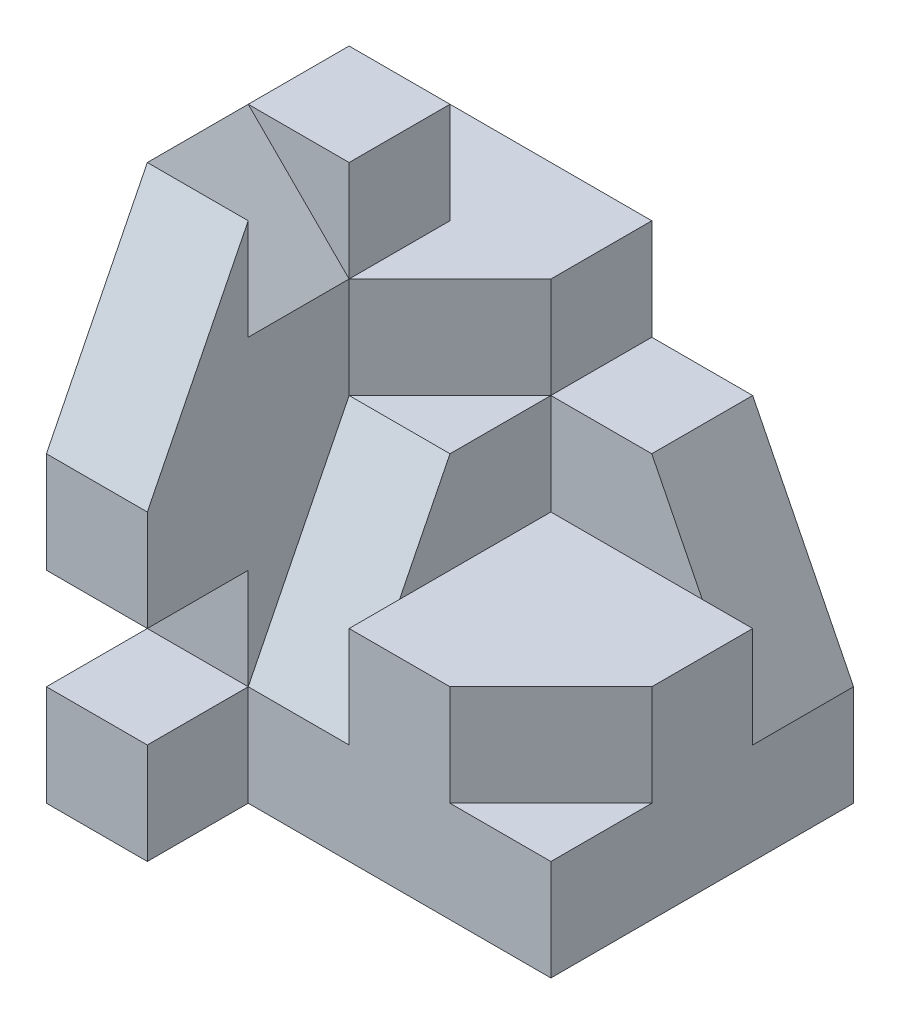
ISO-10303-21;
HEADER;
FILE_DESCRIPTION(('STEP AP214'),'2;1');
FILE_NAME('part.step','',(''),(''),'','','');
FILE_SCHEMA(('AUTOMOTIVE_DESIGN { 1 0 10303 214 1 1 1 1 }'));
ENDSEC;
DATA;
#1=APPLICATION_CONTEXT('core data for automotive mechanical design processes');
#2=APPLICATION_PROTOCOL_DEFINITION('international standard','automotive_design',2000,#1);
#3=PRODUCT_CONTEXT('',#1,'mechanical');
#4=PRODUCT('Part','Part','',(#3));
#5=PRODUCT_RELATED_PRODUCT_CATEGORY('part','',(#4));
#6=PRODUCT_DEFINITION_FORMATION('','',#4);
#7=PRODUCT_DEFINITION_CONTEXT('part definition',#1,'design');
#8=PRODUCT_DEFINITION('design','',#6,#7);
#9=PRODUCT_DEFINITION_SHAPE('','',#8);
#10=(LENGTH_UNIT() NAMED_UNIT(*) SI_UNIT(.MILLI.,.METRE.));
#11=(NAMED_UNIT(*) PLANE_ANGLE_UNIT() SI_UNIT($,.RADIAN.));
#12=(NAMED_UNIT(*) SI_UNIT($,.STERADIAN.) SOLID_ANGLE_UNIT());
#13=UNCERTAINTY_MEASURE_WITH_UNIT(LENGTH_MEASURE(1.E-05),#10,'distance_accuracy_value','');
#14=(GEOMETRIC_REPRESENTATION_CONTEXT(3) GLOBAL_UNCERTAINTY_ASSIGNED_CONTEXT((#13)) GLOBAL_UNIT_ASSIGNED_CONTEXT((#10,
#11,#12)) REPRESENTATION_CONTEXT('',''));
#15=CARTESIAN_POINT('',(0.,0.,0.));
#16=DIRECTION('',(0.,0.,1.));
#17=DIRECTION('',(1.,0.,0.));
#18=AXIS2_PLACEMENT_3D('',#15,#16,#17);
#19=CARTESIAN_POINT('',(-0.999999999999999,-2.5,3.));
#20=DIRECTION('',(-1.,0.,0.));
#21=DIRECTION('',(0.,0.,1.));
#22=AXIS2_PLACEMENT_3D('',#19,#20,#21);
#23=PLANE('',#22);
#24=DIRECTION('',(0.,0.,1.));
#25=VECTOR('',#24,1.);
#26=CARTESIAN_POINT('',(-0.999999999999999,2.5,1.));
#27=LINE('',#26,#25);
#28=CARTESIAN_POINT('',(-0.999999999999999,2.5,1.));
#29=VERTEX_POINT('',#28);
#30=CARTESIAN_POINT('',(-1.,2.5,2.));
#31=VERTEX_POINT('',#30);
#32=EDGE_CURVE('E222',#29,#31,#27,.T.);
#33=ORIENTED_EDGE('',*,*,#32,.T.);
#34=DIRECTION('',(0.,-1.,0.));
#35=VECTOR('',#34,1.);
#36=CARTESIAN_POINT('',(-0.999999999999999,-2.5,2.));
#37=LINE('',#36,#35);
#38=CARTESIAN_POINT('',(-0.999999999999999,1.5,2.));
#39=VERTEX_POINT('',#38);
#40=EDGE_CURVE('E211',#31,#39,#37,.T.);
#41=ORIENTED_EDGE('',*,*,#40,.T.);
#42=DIRECTION('',(0.,0.,1.));
#43=VECTOR('',#42,1.);
#44=CARTESIAN_POINT('',(-0.999999999999999,1.5,1.));
#45=LINE('',#44,#43);
#46=CARTESIAN_POINT('',(-0.999999999999999,1.5,1.));
#47=VERTEX_POINT('',#46);
#48=EDGE_CURVE('E219',#47,#39,#45,.T.);
#49=ORIENTED_EDGE('',*,*,#48,.F.);
#50=DIRECTION('',(0.,1.,0.));
#51=VECTOR('',#50,1.);
#52=CARTESIAN_POINT('',(-0.999999999999999,1.5,1.));
#53=LINE('',#52,#51);
#54=EDGE_CURVE('E252',#47,#29,#53,.T.);
#55=ORIENTED_EDGE('',*,*,#54,.T.);
#56=EDGE_LOOP('',(#33,#41,#49,#55));
#57=FACE_BOUND('',#56,.T.);
#58=ADVANCED_FACE('F33',(#57),#23,.F.);
#59=CARTESIAN_POINT('',(2.,-2.5,3.));
#60=DIRECTION('',(0.,0.,-1.));
#61=DIRECTION('',(-1.,0.,0.));
#62=AXIS2_PLACEMENT_3D('',#59,#60,#61);
#63=PLANE('',#62);
#64=DIRECTION('',(0.,-1.,0.));
#65=VECTOR('',#64,1.);
#66=CARTESIAN_POINT('',(-0.999999999999999,-2.5,3.));
#67=LINE('',#66,#65);
#68=CARTESIAN_POINT('',(-0.999999999999999,-0.500000000000001,3.));
#69=VERTEX_POINT('',#68);
#70=CARTESIAN_POINT('',(-0.999999999999999,-1.5,3.));
#71=VERTEX_POINT('',#70);
#72=EDGE_CURVE('E244',#69,#71,#67,.T.);
#73=ORIENTED_EDGE('',*,*,#72,.F.);
#74=DIRECTION('',(1.,0.,0.));
#75=VECTOR('',#74,1.);
#76=CARTESIAN_POINT('',(-2.,-0.500000000000001,3.));
#77=LINE('',#76,#75);
#78=CARTESIAN_POINT('',(-2.,-0.500000000000001,3.));
#79=VERTEX_POINT('',#78);
#80=EDGE_CURVE('E294',#79,#69,#77,.T.);
#81=ORIENTED_EDGE('',*,*,#80,.F.);
#82=DIRECTION('',(0.,1.,0.));
#83=VECTOR('',#82,1.);
#84=CARTESIAN_POINT('',(-2.,-1.5,3.));
#85=LINE('',#84,#83);
#86=CARTESIAN_POINT('',(-2.,-1.5,3.));
#87=VERTEX_POINT('',#86);
#88=EDGE_CURVE('E279',#87,#79,#85,.T.);
#89=ORIENTED_EDGE('',*,*,#88,.F.);
#90=DIRECTION('',(1.,0.,0.));
#91=VECTOR('',#90,1.);
#92=CARTESIAN_POINT('',(-2.,-1.5,3.));
#93=LINE('',#92,#91);
#94=EDGE_CURVE('E297',#87,#71,#93,.T.);
#95=ORIENTED_EDGE('',*,*,#94,.T.);
#96=EDGE_LOOP('',(#73,#81,#89,#95));
#97=FACE_BOUND('',#96,.T.);
#98=ADVANCED_FACE('F480',(#97),#63,.F.);
#99=DIRECTION('',(0.,1.,0.));
#100=VECTOR('',#99,1.);
#101=CARTESIAN_POINT('',(0.,-2.5,3.));
#102=LINE('',#101,#100);
#103=CARTESIAN_POINT('',(0.,-1.5,3.));
#104=VERTEX_POINT('',#103);
#105=CARTESIAN_POINT('',(0.,-0.5,3.));
#106=VERTEX_POINT('',#105);
#107=EDGE_CURVE('E422',#104,#106,#102,.T.);
#108=ORIENTED_EDGE('',*,*,#107,.F.);
#109=DIRECTION('',(1.,0.,0.));
#110=VECTOR('',#109,1.);
#111=CARTESIAN_POINT('',(0.,-1.5,3.));
#112=LINE('',#111,#110);
#113=EDGE_CURVE('E418',#71,#104,#112,.T.);
#114=ORIENTED_EDGE('',*,*,#113,.F.);
#115=DIRECTION('',(0.,1.,0.));
#116=VECTOR('',#115,1.);
#117=CARTESIAN_POINT('',(-0.999999999999999,-2.5,3.));
#118=LINE('',#117,#116);
#119=CARTESIAN_POINT('',(-0.999999999999999,-2.5,3.));
#120=VERTEX_POINT('',#119);
#121=EDGE_CURVE('E312',#120,#71,#118,.T.);
#122=ORIENTED_EDGE('',*,*,#121,.F.);
#123=DIRECTION('',(-1.,0.,0.));
#124=VECTOR('',#123,1.);
#125=CARTESIAN_POINT('',(2.,-2.5,3.));
#126=LINE('',#125,#124);
#127=CARTESIAN_POINT('',(2.,-2.5,3.));
#128=VERTEX_POINT('',#127);
#129=EDGE_CURVE('E293',#128,#120,#126,.T.);
#130=ORIENTED_EDGE('',*,*,#129,.F.);
#131=DIRECTION('',(0.,1.,0.));
#132=VECTOR('',#131,1.);
#133=CARTESIAN_POINT('',(2.,-2.5,3.));
#134=LINE('',#133,#132);
#135=CARTESIAN_POINT('',(2.,-1.5,3.));
#136=VERTEX_POINT('',#135);
#137=EDGE_CURVE('E306',#128,#136,#134,.T.);
#138=ORIENTED_EDGE('',*,*,#137,.T.);
#139=DIRECTION('',(1.,0.,0.));
#140=VECTOR('',#139,1.);
#141=CARTESIAN_POINT('',(1.,-1.5,3.));
#142=LINE('',#141,#140);
#143=CARTESIAN_POINT('',(1.,-1.5,3.));
#144=VERTEX_POINT('',#143);
#145=EDGE_CURVE('E372',#144,#136,#142,.T.);
#146=ORIENTED_EDGE('',*,*,#145,.F.);
#147=DIRECTION('',(0.,1.,0.));
#148=VECTOR('',#147,1.);
#149=CARTESIAN_POINT('',(1.,-1.5,3.));
#150=LINE('',#149,#148);
#151=CARTESIAN_POINT('',(1.,-0.5,3.));
#152=VERTEX_POINT('',#151);
#153=EDGE_CURVE('E381',#144,#152,#150,.T.);
#154=ORIENTED_EDGE('',*,*,#153,.T.);
#155=DIRECTION('',(1.,0.,0.));
#156=VECTOR('',#155,1.);
#157=CARTESIAN_POINT('',(0.,-0.5,3.));
#158=LINE('',#157,#156);
#159=EDGE_CURVE('E386',#106,#152,#158,.T.);
#160=ORIENTED_EDGE('',*,*,#159,.F.);
#161=EDGE_LOOP('',(#108,#114,#122,#130,#138,#146,#154,#160));
#162=FACE_BOUND('',#161,.T.);
#163=ADVANCED_FACE('F457',(#162),#63,.F.);
#164=CARTESIAN_POINT('',(0.,-0.5,1.));
#165=DIRECTION('',(-1.,0.,0.));
#166=DIRECTION('',(0.,0.,1.));
#167=AXIS2_PLACEMENT_3D('',#164,#165,#166);
#168=PLANE('',#167);
#169=DIRECTION('',(0.,0.,1.));
#170=VECTOR('',#169,1.);
#171=CARTESIAN_POINT('',(0.,1.5,1.));
#172=LINE('',#171,#170);
#173=CARTESIAN_POINT('',(0.,1.5,0.));
#174=VERTEX_POINT('',#173);
#175=CARTESIAN_POINT('',(0.,1.5,1.));
#176=VERTEX_POINT('',#175);
#177=EDGE_CURVE('E384',#174,#176,#172,.T.);
#178=ORIENTED_EDGE('',*,*,#177,.T.);
#179=DIRECTION('',(0.,1.,0.));
#180=VECTOR('',#179,1.);
#181=CARTESIAN_POINT('',(0.,0.5,1.));
#182=LINE('',#181,#180);
#183=CARTESIAN_POINT('',(0.,0.5,1.));
#184=VERTEX_POINT('',#183);
#185=EDGE_CURVE('E235',#184,#176,#182,.T.);
#186=ORIENTED_EDGE('',*,*,#185,.F.);
#187=DIRECTION('',(0.,0.,-1.));
#188=VECTOR('',#187,1.);
#189=CARTESIAN_POINT('',(0.,0.5,1.));
#190=LINE('',#189,#188);
#191=CARTESIAN_POINT('',(0.,0.5,0.));
#192=VERTEX_POINT('',#191);
#193=EDGE_CURVE('E368',#184,#192,#190,.T.);
#194=ORIENTED_EDGE('',*,*,#193,.T.);
#195=DIRECTION('',(0.,1.,0.));
#196=VECTOR('',#195,1.);
#197=CARTESIAN_POINT('',(0.,1.5,0.));
#198=LINE('',#197,#196);
#199=EDGE_CURVE('E356',#192,#174,#198,.T.);
#200=ORIENTED_EDGE('',*,*,#199,.T.);
#201=EDGE_LOOP('',(#178,#186,#194,#200));
#202=FACE_BOUND('',#201,.T.);
#203=ADVANCED_FACE('F467',(#202),#168,.F.);
#204=CARTESIAN_POINT('',(2.,-2.5,4.));
#205=DIRECTION('',(-1.,0.,0.));
#206=DIRECTION('',(0.,0.,1.));
#207=AXIS2_PLACEMENT_3D('',#204,#205,#206);
#208=PLANE('',#207);
#209=DIRECTION('',(0.,1.,0.));
#210=VECTOR('',#209,1.);
#211=CARTESIAN_POINT('',(2.,-2.5,0.));
#212=LINE('',#211,#210);
#213=CARTESIAN_POINT('',(2.,-2.5,0.));
#214=VERTEX_POINT('',#213);
#215=CARTESIAN_POINT('',(2.,-1.5,0.));
#216=VERTEX_POINT('',#215);
#217=EDGE_CURVE('E328',#214,#216,#212,.T.);
#218=ORIENTED_EDGE('',*,*,#217,.T.);
#219=DIRECTION('',(0.,0.,-1.));
#220=VECTOR('',#219,1.);
#221=CARTESIAN_POINT('',(2.,-1.5,1.));
#222=LINE('',#221,#220);
#223=CARTESIAN_POINT('',(2.,-1.5,1.));
#224=VERTEX_POINT('',#223);
#225=EDGE_CURVE('E365',#224,#216,#222,.T.);
#226=ORIENTED_EDGE('',*,*,#225,.F.);
#227=DIRECTION('',(0.,-1.,0.));
#228=VECTOR('',#227,1.);
#229=CARTESIAN_POINT('',(2.,-1.5,1.));
#230=LINE('',#229,#228);
#231=CARTESIAN_POINT('',(2.,-0.5,1.));
#232=VERTEX_POINT('',#231);
#233=EDGE_CURVE('E359',#232,#224,#230,.T.);
#234=ORIENTED_EDGE('',*,*,#233,.F.);
#235=DIRECTION('',(0.,0.,-1.));
#236=VECTOR('',#235,1.);
#237=CARTESIAN_POINT('',(2.,-0.5,3.));
#238=LINE('',#237,#236);
#239=CARTESIAN_POINT('',(2.,-0.5,2.));
#240=VERTEX_POINT('',#239);
#241=EDGE_CURVE('E389',#240,#232,#238,.T.);
#242=ORIENTED_EDGE('',*,*,#241,.F.);
#243=DIRECTION('',(0.,1.,0.));
#244=VECTOR('',#243,1.);
#245=CARTESIAN_POINT('',(2.,-1.5,2.));
#246=LINE('',#245,#244);
#247=CARTESIAN_POINT('',(2.,-1.5,2.));
#248=VERTEX_POINT('',#247);
#249=EDGE_CURVE('E379',#248,#240,#246,.T.);
#250=ORIENTED_EDGE('',*,*,#249,.F.);
#251=DIRECTION('',(0.,0.,-1.));
#252=VECTOR('',#251,1.);
#253=CARTESIAN_POINT('',(2.,-1.5,3.));
#254=LINE('',#253,#252);
#255=EDGE_CURVE('E374',#136,#248,#254,.T.);
#256=ORIENTED_EDGE('',*,*,#255,.F.);
#257=ORIENTED_EDGE('',*,*,#137,.F.);
#258=DIRECTION('',(0.,0.,-1.));
#259=VECTOR('',#258,1.);
#260=CARTESIAN_POINT('',(2.,-2.5,4.));
#261=LINE('',#260,#259);
#262=EDGE_CURVE('E41',#128,#214,#261,.T.);
#263=ORIENTED_EDGE('',*,*,#262,.T.);
#264=EDGE_LOOP('',(#218,#226,#234,#242,#250,#256,#257,#263));
#265=FACE_BOUND('',#264,.T.);
#266=ADVANCED_FACE('F336',(#265),#208,.F.);
#267=CARTESIAN_POINT('',(0.,0.,0.));
#268=DIRECTION('',(0.,0.,1.));
#269=DIRECTION('',(1.,0.,0.));
#270=AXIS2_PLACEMENT_3D('',#267,#268,#269);
#271=PLANE('',#270);
#272=DIRECTION('',(-1.,0.,0.));
#273=VECTOR('',#272,1.);
#274=CARTESIAN_POINT('',(0.,0.5,0.));
#275=LINE('',#274,#273);
#276=CARTESIAN_POINT('',(1.,0.5,0.));
#277=VERTEX_POINT('',#276);
#278=EDGE_CURVE('E353',#277,#192,#275,.T.);
#279=ORIENTED_EDGE('',*,*,#278,.F.);
#280=DIRECTION('',(-0.447213595499958,0.894427190999916,0.));
#281=VECTOR('',#280,1.);
#282=CARTESIAN_POINT('',(1.,0.5,0.));
#283=LINE('',#282,#281);
#284=EDGE_CURVE('E234',#216,#277,#283,.T.);
#285=ORIENTED_EDGE('',*,*,#284,.F.);
#286=ORIENTED_EDGE('',*,*,#217,.F.);
#287=DIRECTION('',(1.,0.,0.));
#288=VECTOR('',#287,1.);
#289=CARTESIAN_POINT('',(2.,-2.5,0.));
#290=LINE('',#289,#288);
#291=CARTESIAN_POINT('',(-2.,-2.5,0.));
#292=VERTEX_POINT('',#291);
#293=EDGE_CURVE('E325',#292,#214,#290,.T.);
#294=ORIENTED_EDGE('',*,*,#293,.F.);
#295=DIRECTION('',(0.,-1.,0.));
#296=VECTOR('',#295,1.);
#297=CARTESIAN_POINT('',(-2.,-2.5,0.));
#298=LINE('',#297,#296);
#299=CARTESIAN_POINT('',(-2.,1.5,0.));
#300=VERTEX_POINT('',#299);
#301=EDGE_CURVE('E310',#300,#292,#298,.T.);
#302=ORIENTED_EDGE('',*,*,#301,.F.);
#303=DIRECTION('',(-1.,0.,0.));
#304=VECTOR('',#303,1.);
#305=CARTESIAN_POINT('',(2.,1.5,0.));
#306=LINE('',#305,#304);
#307=EDGE_CURVE('E263',#174,#300,#306,.T.);
#308=ORIENTED_EDGE('',*,*,#307,.F.);
#309=ORIENTED_EDGE('',*,*,#199,.F.);
#310=EDGE_LOOP('',(#279,#285,#286,#294,#302,#308,#309));
#311=FACE_BOUND('',#310,.T.);
#312=ADVANCED_FACE('F349',(#311),#271,.F.);
#313=CARTESIAN_POINT('',(0.,0.,4.));
#314=DIRECTION('',(0.,0.,1.));
#315=DIRECTION('',(1.,0.,0.));
#316=AXIS2_PLACEMENT_3D('',#313,#314,#315);
#317=PLANE('',#316);
#318=DIRECTION('',(1.,0.,0.));
#319=VECTOR('',#318,1.);
#320=CARTESIAN_POINT('',(-2.,0.499999999999999,4.));
#321=LINE('',#320,#319);
#322=CARTESIAN_POINT('',(-2.,0.499999999999999,4.));
#323=VERTEX_POINT('',#322);
#324=CARTESIAN_POINT('',(-0.999999999999999,0.499999999999999,4.));
#325=VERTEX_POINT('',#324);
#326=EDGE_CURVE('E269',#323,#325,#321,.T.);
#327=ORIENTED_EDGE('',*,*,#326,.F.);
#328=DIRECTION('',(0.,-1.,0.));
#329=VECTOR('',#328,1.);
#330=CARTESIAN_POINT('',(-2.,-2.5,4.));
#331=LINE('',#330,#329);
#332=CARTESIAN_POINT('',(-2.,-0.500000000000001,4.));
#333=VERTEX_POINT('',#332);
#334=EDGE_CURVE('E317',#323,#333,#331,.T.);
#335=ORIENTED_EDGE('',*,*,#334,.T.);
#336=DIRECTION('',(1.,0.,0.));
#337=VECTOR('',#336,1.);
#338=CARTESIAN_POINT('',(-2.,-0.500000000000001,4.));
#339=LINE('',#338,#337);
#340=CARTESIAN_POINT('',(-0.999999999999999,-0.500000000000001,4.));
#341=VERTEX_POINT('',#340);
#342=EDGE_CURVE('E290',#333,#341,#339,.T.);
#343=ORIENTED_EDGE('',*,*,#342,.T.);
#344=DIRECTION('',(0.,1.,0.));
#345=VECTOR('',#344,1.);
#346=CARTESIAN_POINT('',(-0.999999999999999,-2.5,4.));
#347=LINE('',#346,#345);
#348=EDGE_CURVE('E311',#341,#325,#347,.T.);
#349=ORIENTED_EDGE('',*,*,#348,.T.);
#350=EDGE_LOOP('',(#327,#335,#343,#349));
#351=FACE_BOUND('',#350,.T.);
#352=ADVANCED_FACE('F490',(#351),#317,.T.);
#353=DIRECTION('',(0.,0.,1.));
#354=VECTOR('',#353,1.);
#355=CARTESIAN_POINT('',(-0.999999999999999,1.5,2.));
#356=LINE('',#355,#354);
#357=CARTESIAN_POINT('',(-0.999999999999999,1.5,3.));
#358=VERTEX_POINT('',#357);
#359=EDGE_CURVE('E197',#39,#358,#356,.T.);
#360=ORIENTED_EDGE('',*,*,#359,.T.);
#361=DIRECTION('',(0.,1.,0.));
#362=VECTOR('',#361,1.);
#363=CARTESIAN_POINT('',(-0.999999999999999,-2.5,3.));
#364=LINE('',#363,#362);
#365=CARTESIAN_POINT('',(-0.999999999999999,2.5,3.));
#366=VERTEX_POINT('',#365);
#367=EDGE_CURVE('E223',#358,#366,#364,.T.);
#368=ORIENTED_EDGE('',*,*,#367,.T.);
#369=DIRECTION('',(0.,0.894427190999916,-0.447213595499958));
#370=VECTOR('',#369,1.);
#371=CARTESIAN_POINT('',(-0.999999999999999,2.5,3.));
#372=LINE('',#371,#370);
#373=EDGE_CURVE('E264',#325,#366,#372,.T.);
#374=ORIENTED_EDGE('',*,*,#373,.F.);
#375=ORIENTED_EDGE('',*,*,#348,.F.);
#376=DIRECTION('',(0.,0.,1.));
#377=VECTOR('',#376,1.);
#378=CARTESIAN_POINT('',(-0.999999999999999,-0.500000000000001,3.));
#379=LINE('',#378,#377);
#380=EDGE_CURVE('E280',#69,#341,#379,.T.);
#381=ORIENTED_EDGE('',*,*,#380,.F.);
#382=ORIENTED_EDGE('',*,*,#72,.T.);
#383=DIRECTION('',(0.,-0.894427190999916,0.447213595499958));
#384=VECTOR('',#383,1.);
#385=CARTESIAN_POINT('',(-0.999999999999999,-1.5,3.));
#386=LINE('',#385,#384);
#387=CARTESIAN_POINT('',(-0.999999999999999,0.5,2.));
#388=VERTEX_POINT('',#387);
#389=EDGE_CURVE('E230',#388,#71,#386,.T.);
#390=ORIENTED_EDGE('',*,*,#389,.F.);
#391=DIRECTION('',(0.,1.,0.));
#392=VECTOR('',#391,1.);
#393=CARTESIAN_POINT('',(-0.999999999999999,0.5,2.));
#394=LINE('',#393,#392);
#395=EDGE_CURVE('E226',#388,#39,#394,.T.);
#396=ORIENTED_EDGE('',*,*,#395,.T.);
#397=EDGE_LOOP('',(#360,#368,#374,#375,#381,#382,#390,#396));
#398=FACE_BOUND('',#397,.T.);
#399=ADVANCED_FACE('F228',(#398),#23,.F.);
#400=CARTESIAN_POINT('',(-2.,-2.5,4.));
#401=DIRECTION('',(1.,0.,0.));
#402=DIRECTION('',(0.,0.,-1.));
#403=AXIS2_PLACEMENT_3D('',#400,#401,#402);
#404=PLANE('',#403);
#405=DIRECTION('',(0.,0.,-1.));
#406=VECTOR('',#405,1.);
#407=CARTESIAN_POINT('',(-2.,2.5,4.));
#408=LINE('',#407,#406);
#409=CARTESIAN_POINT('',(-2.,2.5,3.));
#410=VERTEX_POINT('',#409);
#411=CARTESIAN_POINT('',(-2.,2.5,2.));
#412=VERTEX_POINT('',#411);
#413=EDGE_CURVE('E331',#410,#412,#408,.T.);
#414=ORIENTED_EDGE('',*,*,#413,.T.);
#415=CARTESIAN_POINT('',(-2.,2.5,1.));
#416=VERTEX_POINT('',#415);
#417=EDGE_CURVE('E323',#412,#416,#408,.T.);
#418=ORIENTED_EDGE('',*,*,#417,.T.);
#419=DIRECTION('',(0.,1.,0.));
#420=VECTOR('',#419,1.);
#421=CARTESIAN_POINT('',(-2.,1.5,1.));
#422=LINE('',#421,#420);
#423=CARTESIAN_POINT('',(-2.,1.5,1.));
#424=VERTEX_POINT('',#423);
#425=EDGE_CURVE('E249',#424,#416,#422,.T.);
#426=ORIENTED_EDGE('',*,*,#425,.F.);
#427=DIRECTION('',(0.,0.,1.));
#428=VECTOR('',#427,1.);
#429=CARTESIAN_POINT('',(-2.,1.5,0.));
#430=LINE('',#429,#428);
#431=EDGE_CURVE('E254',#300,#424,#430,.T.);
#432=ORIENTED_EDGE('',*,*,#431,.F.);
#433=ORIENTED_EDGE('',*,*,#301,.T.);
#434=DIRECTION('',(0.,0.,-1.));
#435=VECTOR('',#434,1.);
#436=CARTESIAN_POINT('',(-2.,-2.5,4.));
#437=LINE('',#436,#435);
#438=CARTESIAN_POINT('',(-2.,-2.5,4.));
#439=VERTEX_POINT('',#438);
#440=EDGE_CURVE('E11',#439,#292,#437,.T.);
#441=ORIENTED_EDGE('',*,*,#440,.F.);
#442=CARTESIAN_POINT('',(-2.,-1.5,4.));
#443=VERTEX_POINT('',#442);
#444=EDGE_CURVE('E320',#443,#439,#331,.T.);
#445=ORIENTED_EDGE('',*,*,#444,.F.);
#446=DIRECTION('',(0.,0.,-1.));
#447=VECTOR('',#446,1.);
#448=CARTESIAN_POINT('',(-2.,-1.5,4.));
#449=LINE('',#448,#447);
#450=EDGE_CURVE('E276',#443,#87,#449,.T.);
#451=ORIENTED_EDGE('',*,*,#450,.T.);
#452=ORIENTED_EDGE('',*,*,#88,.T.);
#453=DIRECTION('',(0.,0.,1.));
#454=VECTOR('',#453,1.);
#455=CARTESIAN_POINT('',(-2.,-0.500000000000001,3.));
#456=LINE('',#455,#454);
#457=EDGE_CURVE('E283',#79,#333,#456,.T.);
#458=ORIENTED_EDGE('',*,*,#457,.T.);
#459=ORIENTED_EDGE('',*,*,#334,.F.);
#460=DIRECTION('',(0.,0.894427190999916,-0.447213595499958));
#461=VECTOR('',#460,1.);
#462=CARTESIAN_POINT('',(-2.,2.5,3.));
#463=LINE('',#462,#461);
#464=EDGE_CURVE('E266',#323,#410,#463,.T.);
#465=ORIENTED_EDGE('',*,*,#464,.T.);
#466=EDGE_LOOP('',(#414,#418,#426,#432,#433,#441,#445,#451,#452,#458,#459,#465));
#467=FACE_BOUND('',#466,.T.);
#468=ADVANCED_FACE('F35',(#467),#404,.F.);
#469=CARTESIAN_POINT('',(2.,-2.5,4.));
#470=DIRECTION('',(0.,1.,0.));
#471=DIRECTION('',(-1.,0.,0.));
#472=AXIS2_PLACEMENT_3D('',#469,#470,#471);
#473=PLANE('',#472);
#474=ORIENTED_EDGE('',*,*,#129,.T.);
#475=DIRECTION('',(0.,0.,1.));
#476=VECTOR('',#475,1.);
#477=CARTESIAN_POINT('',(-0.999999999999999,-2.5,3.));
#478=LINE('',#477,#476);
#479=CARTESIAN_POINT('',(-0.999999999999999,-2.5,4.));
#480=VERTEX_POINT('',#479);
#481=EDGE_CURVE('E303',#120,#480,#478,.T.);
#482=ORIENTED_EDGE('',*,*,#481,.T.);
#483=DIRECTION('',(1.,0.,0.));
#484=VECTOR('',#483,1.);
#485=CARTESIAN_POINT('',(2.,-2.5,4.));
#486=LINE('',#485,#484);
#487=EDGE_CURVE('E319',#439,#480,#486,.T.);
#488=ORIENTED_EDGE('',*,*,#487,.F.);
#489=ORIENTED_EDGE('',*,*,#440,.T.);
#490=ORIENTED_EDGE('',*,*,#293,.T.);
#491=ORIENTED_EDGE('',*,*,#262,.F.);
#492=EDGE_LOOP('',(#474,#482,#488,#489,#490,#491));
#493=FACE_BOUND('',#492,.T.);
#494=ADVANCED_FACE('F342',(#493),#473,.F.);
#495=CARTESIAN_POINT('',(2.,2.5,4.));
#496=DIRECTION('',(0.,-1.,0.));
#497=DIRECTION('',(0.,0.,-1.));
#498=AXIS2_PLACEMENT_3D('',#495,#496,#497);
#499=PLANE('',#498);
#500=ORIENTED_EDGE('',*,*,#417,.F.);
#501=DIRECTION('',(1.,0.,0.));
#502=VECTOR('',#501,1.);
#503=CARTESIAN_POINT('',(2.,2.5,2.));
#504=LINE('',#503,#502);
#505=EDGE_CURVE('E213',#412,#31,#504,.T.);
#506=ORIENTED_EDGE('',*,*,#505,.T.);
#507=ORIENTED_EDGE('',*,*,#32,.F.);
#508=DIRECTION('',(1.,0.,0.));
#509=VECTOR('',#508,1.);
#510=CARTESIAN_POINT('',(-2.,2.5,1.));
#511=LINE('',#510,#509);
#512=EDGE_CURVE('E258',#416,#29,#511,.T.);
#513=ORIENTED_EDGE('',*,*,#512,.F.);
#514=EDGE_LOOP('',(#500,#506,#507,#513));
#515=FACE_BOUND('',#514,.T.);
#516=ADVANCED_FACE('F410',(#515),#499,.F.);
#517=DIRECTION('',(1.,0.,0.));
#518=VECTOR('',#517,1.);
#519=CARTESIAN_POINT('',(-2.,-1.5,4.));
#520=LINE('',#519,#518);
#521=CARTESIAN_POINT('',(-0.999999999999999,-1.5,4.));
#522=VERTEX_POINT('',#521);
#523=EDGE_CURVE('E286',#443,#522,#520,.T.);
#524=ORIENTED_EDGE('',*,*,#523,.F.);
#525=ORIENTED_EDGE('',*,*,#444,.T.);
#526=ORIENTED_EDGE('',*,*,#487,.T.);
#527=EDGE_CURVE('E307',#480,#522,#347,.T.);
#528=ORIENTED_EDGE('',*,*,#527,.T.);
#529=EDGE_LOOP('',(#524,#525,#526,#528));
#530=FACE_BOUND('',#529,.T.);
#531=ADVANCED_FACE('F464',(#530),#317,.T.);
#532=ORIENTED_EDGE('',*,*,#121,.T.);
#533=DIRECTION('',(0.,0.,-1.));
#534=VECTOR('',#533,1.);
#535=CARTESIAN_POINT('',(-0.999999999999999,-1.5,4.));
#536=LINE('',#535,#534);
#537=EDGE_CURVE('E274',#522,#71,#536,.T.);
#538=ORIENTED_EDGE('',*,*,#537,.F.);
#539=ORIENTED_EDGE('',*,*,#527,.F.);
#540=ORIENTED_EDGE('',*,*,#481,.F.);
#541=EDGE_LOOP('',(#532,#538,#539,#540));
#542=FACE_BOUND('',#541,.T.);
#543=ADVANCED_FACE('F482',(#542),#23,.F.);
#544=CARTESIAN_POINT('',(-2.,-0.500000000000001,3.));
#545=DIRECTION('',(0.,1.,0.));
#546=DIRECTION('',(0.,0.,1.));
#547=AXIS2_PLACEMENT_3D('',#544,#545,#546);
#548=PLANE('',#547);
#549=ORIENTED_EDGE('',*,*,#380,.T.);
#550=ORIENTED_EDGE('',*,*,#342,.F.);
#551=ORIENTED_EDGE('',*,*,#457,.F.);
#552=ORIENTED_EDGE('',*,*,#80,.T.);
#553=EDGE_LOOP('',(#549,#550,#551,#552));
#554=FACE_BOUND('',#553,.T.);
#555=ADVANCED_FACE('F492',(#554),#548,.F.);
#556=CARTESIAN_POINT('',(-2.,-1.5,4.));
#557=DIRECTION('',(0.,-1.,0.));
#558=DIRECTION('',(0.,0.,-1.));
#559=AXIS2_PLACEMENT_3D('',#556,#557,#558);
#560=PLANE('',#559);
#561=ORIENTED_EDGE('',*,*,#537,.T.);
#562=ORIENTED_EDGE('',*,*,#94,.F.);
#563=ORIENTED_EDGE('',*,*,#450,.F.);
#564=ORIENTED_EDGE('',*,*,#523,.T.);
#565=EDGE_LOOP('',(#561,#562,#563,#564));
#566=FACE_BOUND('',#565,.T.);
#567=ADVANCED_FACE('F497',(#566),#560,.F.);
#568=CARTESIAN_POINT('',(-2.,2.5,3.));
#569=DIRECTION('',(0.,-0.447213595499958,-0.894427190999916));
#570=DIRECTION('',(0.,0.894427190999916,-0.447213595499958));
#571=AXIS2_PLACEMENT_3D('',#568,#569,#570);
#572=PLANE('',#571);
#573=ORIENTED_EDGE('',*,*,#373,.T.);
#574=DIRECTION('',(1.,0.,0.));
#575=VECTOR('',#574,1.);
#576=CARTESIAN_POINT('',(-2.,2.5,3.));
#577=LINE('',#576,#575);
#578=EDGE_CURVE('E272',#410,#366,#577,.T.);
#579=ORIENTED_EDGE('',*,*,#578,.F.);
#580=ORIENTED_EDGE('',*,*,#464,.F.);
#581=ORIENTED_EDGE('',*,*,#326,.T.);
#582=EDGE_LOOP('',(#573,#579,#580,#581));
#583=FACE_BOUND('',#582,.T.);
#584=ADVANCED_FACE('F515',(#583),#572,.F.);
#585=CARTESIAN_POINT('',(-2.,1.5,1.));
#586=DIRECTION('',(0.,0.,1.));
#587=DIRECTION('',(1.,0.,0.));
#588=AXIS2_PLACEMENT_3D('',#585,#586,#587);
#589=PLANE('',#588);
#590=ORIENTED_EDGE('',*,*,#512,.T.);
#591=ORIENTED_EDGE('',*,*,#54,.F.);
#592=DIRECTION('',(1.,0.,0.));
#593=VECTOR('',#592,1.);
#594=CARTESIAN_POINT('',(-2.,1.5,1.));
#595=LINE('',#594,#593);
#596=EDGE_CURVE('E248',#424,#47,#595,.T.);
#597=ORIENTED_EDGE('',*,*,#596,.F.);
#598=ORIENTED_EDGE('',*,*,#425,.T.);
#599=EDGE_LOOP('',(#590,#591,#597,#598));
#600=FACE_BOUND('',#599,.T.);
#601=ADVANCED_FACE('F408',(#600),#589,.F.);
#602=CARTESIAN_POINT('',(0.,1.5,0.));
#603=DIRECTION('',(0.,1.,0.));
#604=DIRECTION('',(0.,0.,1.));
#605=AXIS2_PLACEMENT_3D('',#602,#603,#604);
#606=PLANE('',#605);
#607=DIRECTION('',(-0.707106781186548,0.,0.707106781186548));
#608=VECTOR('',#607,1.);
#609=CARTESIAN_POINT('',(0.,1.5,1.));
#610=LINE('',#609,#608);
#611=EDGE_CURVE('E238',#176,#39,#610,.T.);
#612=ORIENTED_EDGE('',*,*,#611,.F.);
#613=ORIENTED_EDGE('',*,*,#177,.F.);
#614=ORIENTED_EDGE('',*,*,#307,.T.);
#615=ORIENTED_EDGE('',*,*,#431,.T.);
#616=ORIENTED_EDGE('',*,*,#596,.T.);
#617=ORIENTED_EDGE('',*,*,#48,.T.);
#618=EDGE_LOOP('',(#612,#613,#614,#615,#616,#617));
#619=FACE_BOUND('',#618,.T.);
#620=ADVANCED_FACE('F246',(#619),#606,.T.);
#621=DIRECTION('',(0.,0.,-1.));
#622=VECTOR('',#621,1.);
#623=CARTESIAN_POINT('',(0.,0.5,3.));
#624=LINE('',#623,#622);
#625=CARTESIAN_POINT('',(0.,0.5,2.));
#626=VERTEX_POINT('',#625);
#627=EDGE_CURVE('E243',#626,#184,#624,.T.);
#628=ORIENTED_EDGE('',*,*,#627,.F.);
#629=DIRECTION('',(0.,0.894427190999916,-0.447213595499958));
#630=VECTOR('',#629,1.);
#631=CARTESIAN_POINT('',(0.,0.5,2.));
#632=LINE('',#631,#630);
#633=CARTESIAN_POINT('',(0.,-0.5,2.5));
#634=VERTEX_POINT('',#633);
#635=EDGE_CURVE('E48',#634,#626,#632,.T.);
#636=ORIENTED_EDGE('',*,*,#635,.F.);
#637=DIRECTION('',(0.,0.,1.));
#638=VECTOR('',#637,1.);
#639=CARTESIAN_POINT('',(0.,-0.5,1.));
#640=LINE('',#639,#638);
#641=CARTESIAN_POINT('',(0.,-0.5,1.));
#642=VERTEX_POINT('',#641);
#643=EDGE_CURVE('E396',#642,#634,#640,.T.);
#644=ORIENTED_EDGE('',*,*,#643,.F.);
#645=DIRECTION('',(0.,1.,0.));
#646=VECTOR('',#645,1.);
#647=CARTESIAN_POINT('',(0.,-0.5,1.));
#648=LINE('',#647,#646);
#649=EDGE_CURVE('E261',#642,#184,#648,.T.);
#650=ORIENTED_EDGE('',*,*,#649,.T.);
#651=EDGE_LOOP('',(#628,#636,#644,#650));
#652=FACE_BOUND('',#651,.T.);
#653=ADVANCED_FACE('F609',(#652),#168,.F.);
#654=CARTESIAN_POINT('',(2.,-0.5,1.));
#655=DIRECTION('',(0.,0.,-1.));
#656=DIRECTION('',(-1.,0.,0.));
#657=AXIS2_PLACEMENT_3D('',#654,#655,#656);
#658=PLANE('',#657);
#659=DIRECTION('',(-1.,0.,0.));
#660=VECTOR('',#659,1.);
#661=CARTESIAN_POINT('',(2.,-0.5,1.));
#662=LINE('',#661,#660);
#663=CARTESIAN_POINT('',(1.5,-0.5,1.));
#664=VERTEX_POINT('',#663);
#665=EDGE_CURVE('E392',#664,#642,#662,.T.);
#666=ORIENTED_EDGE('',*,*,#665,.F.);
#667=DIRECTION('',(-0.447213595499958,0.894427190999916,0.));
#668=VECTOR('',#667,1.);
#669=CARTESIAN_POINT('',(1.,0.5,1.));
#670=LINE('',#669,#668);
#671=CARTESIAN_POINT('',(1.,0.5,1.));
#672=VERTEX_POINT('',#671);
#673=EDGE_CURVE('E364',#664,#672,#670,.T.);
#674=ORIENTED_EDGE('',*,*,#673,.T.);
#675=DIRECTION('',(-1.,0.,0.));
#676=VECTOR('',#675,1.);
#677=CARTESIAN_POINT('',(0.,0.5,1.));
#678=LINE('',#677,#676);
#679=EDGE_CURVE('E432',#672,#184,#678,.T.);
#680=ORIENTED_EDGE('',*,*,#679,.T.);
#681=ORIENTED_EDGE('',*,*,#649,.F.);
#682=EDGE_LOOP('',(#666,#674,#680,#681));
#683=FACE_BOUND('',#682,.T.);
#684=ADVANCED_FACE('F443',(#683),#658,.F.);
#685=CARTESIAN_POINT('',(0.,-0.5,0.));
#686=DIRECTION('',(0.,1.,0.));
#687=DIRECTION('',(0.,0.,1.));
#688=AXIS2_PLACEMENT_3D('',#685,#686,#687);
#689=PLANE('',#688);
#690=DIRECTION('',(-0.707106781186548,0.,0.707106781186548));
#691=VECTOR('',#690,1.);
#692=CARTESIAN_POINT('',(2.,-0.5,2.));
#693=LINE('',#692,#691);
#694=EDGE_CURVE('E367',#240,#152,#693,.T.);
#695=ORIENTED_EDGE('',*,*,#694,.F.);
#696=ORIENTED_EDGE('',*,*,#241,.T.);
#697=EDGE_CURVE('E393',#232,#664,#662,.T.);
#698=ORIENTED_EDGE('',*,*,#697,.T.);
#699=ORIENTED_EDGE('',*,*,#665,.T.);
#700=ORIENTED_EDGE('',*,*,#643,.T.);
#701=DIRECTION('',(0.,0.,1.));
#702=VECTOR('',#701,1.);
#703=CARTESIAN_POINT('',(0.,-0.5,0.));
#704=LINE('',#703,#702);
#705=EDGE_CURVE('E424',#634,#106,#704,.T.);
#706=ORIENTED_EDGE('',*,*,#705,.T.);
#707=ORIENTED_EDGE('',*,*,#159,.T.);
#708=EDGE_LOOP('',(#695,#696,#698,#699,#700,#706,#707));
#709=FACE_BOUND('',#708,.T.);
#710=ADVANCED_FACE('F447',(#709),#689,.T.);
#711=CARTESIAN_POINT('',(2.,-1.5,2.));
#712=DIRECTION('',(-0.707106781186547,0.,-0.707106781186547));
#713=DIRECTION('',(-0.707106781186548,0.,0.707106781186548));
#714=AXIS2_PLACEMENT_3D('',#711,#712,#713);
#715=PLANE('',#714);
#716=ORIENTED_EDGE('',*,*,#694,.T.);
#717=ORIENTED_EDGE('',*,*,#153,.F.);
#718=DIRECTION('',(-0.707106781186548,0.,0.707106781186548));
#719=VECTOR('',#718,1.);
#720=CARTESIAN_POINT('',(2.,-1.5,2.));
#721=LINE('',#720,#719);
#722=EDGE_CURVE('E376',#248,#144,#721,.T.);
#723=ORIENTED_EDGE('',*,*,#722,.F.);
#724=ORIENTED_EDGE('',*,*,#249,.T.);
#725=EDGE_LOOP('',(#716,#717,#723,#724));
#726=FACE_BOUND('',#725,.T.);
#727=ADVANCED_FACE('F451',(#726),#715,.F.);
#728=CARTESIAN_POINT('',(0.,-1.5,0.));
#729=DIRECTION('',(0.,1.,0.));
#730=DIRECTION('',(0.,0.,1.));
#731=AXIS2_PLACEMENT_3D('',#728,#729,#730);
#732=PLANE('',#731);
#733=ORIENTED_EDGE('',*,*,#145,.T.);
#734=ORIENTED_EDGE('',*,*,#255,.T.);
#735=ORIENTED_EDGE('',*,*,#722,.T.);
#736=EDGE_LOOP('',(#733,#734,#735));
#737=FACE_BOUND('',#736,.T.);
#738=ADVANCED_FACE('F454',(#737),#732,.T.);
#739=CARTESIAN_POINT('',(1.,0.5,1.));
#740=DIRECTION('',(-0.894427190999916,-0.447213595499958,0.));
#741=DIRECTION('',(0.447213595499958,-0.894427190999916,0.));
#742=AXIS2_PLACEMENT_3D('',#739,#740,#741);
#743=PLANE('',#742);
#744=ORIENTED_EDGE('',*,*,#284,.T.);
#745=DIRECTION('',(0.,0.,-1.));
#746=VECTOR('',#745,1.);
#747=CARTESIAN_POINT('',(1.,0.5,1.));
#748=LINE('',#747,#746);
#749=EDGE_CURVE('E370',#672,#277,#748,.T.);
#750=ORIENTED_EDGE('',*,*,#749,.F.);
#751=ORIENTED_EDGE('',*,*,#673,.F.);
#752=EDGE_CURVE('E56',#224,#664,#670,.T.);
#753=ORIENTED_EDGE('',*,*,#752,.F.);
#754=ORIENTED_EDGE('',*,*,#225,.T.);
#755=EDGE_LOOP('',(#744,#750,#751,#753,#754));
#756=FACE_BOUND('',#755,.T.);
#757=ADVANCED_FACE('F441',(#756),#743,.F.);
#758=CARTESIAN_POINT('',(0.,0.5,1.));
#759=DIRECTION('',(0.,-1.,0.));
#760=DIRECTION('',(1.,0.,0.));
#761=AXIS2_PLACEMENT_3D('',#758,#759,#760);
#762=PLANE('',#761);
#763=ORIENTED_EDGE('',*,*,#278,.T.);
#764=ORIENTED_EDGE('',*,*,#193,.F.);
#765=ORIENTED_EDGE('',*,*,#679,.F.);
#766=ORIENTED_EDGE('',*,*,#749,.T.);
#767=EDGE_LOOP('',(#763,#764,#765,#766));
#768=FACE_BOUND('',#767,.T.);
#769=ADVANCED_FACE('F470',(#768),#762,.F.);
#770=CARTESIAN_POINT('',(0.,0.,1.));
#771=DIRECTION('',(0.,0.,-1.));
#772=DIRECTION('',(-1.,0.,0.));
#773=AXIS2_PLACEMENT_3D('',#770,#771,#772);
#774=PLANE('',#773);
#775=ORIENTED_EDGE('',*,*,#233,.T.);
#776=ORIENTED_EDGE('',*,*,#752,.T.);
#777=ORIENTED_EDGE('',*,*,#697,.F.);
#778=EDGE_LOOP('',(#775,#776,#777));
#779=FACE_BOUND('',#778,.T.);
#780=ADVANCED_FACE('F439',(#779),#774,.T.);
#781=CARTESIAN_POINT('',(0.,0.5,1.));
#782=DIRECTION('',(-0.707106781186548,0.,-0.707106781186547));
#783=DIRECTION('',(-0.707106781186547,0.,0.707106781186548));
#784=AXIS2_PLACEMENT_3D('',#781,#782,#783);
#785=PLANE('',#784);
#786=ORIENTED_EDGE('',*,*,#611,.T.);
#787=ORIENTED_EDGE('',*,*,#395,.F.);
#788=DIRECTION('',(-0.707106781186548,0.,0.707106781186548));
#789=VECTOR('',#788,1.);
#790=CARTESIAN_POINT('',(0.,0.5,1.));
#791=LINE('',#790,#789);
#792=EDGE_CURVE('E429',#184,#388,#791,.T.);
#793=ORIENTED_EDGE('',*,*,#792,.F.);
#794=ORIENTED_EDGE('',*,*,#185,.T.);
#795=EDGE_LOOP('',(#786,#787,#793,#794));
#796=FACE_BOUND('',#795,.T.);
#797=ADVANCED_FACE('F239',(#796),#785,.F.);
#798=CARTESIAN_POINT('',(0.,0.5,0.));
#799=DIRECTION('',(0.,-1.,0.));
#800=DIRECTION('',(0.,0.,-1.));
#801=AXIS2_PLACEMENT_3D('',#798,#799,#800);
#802=PLANE('',#801);
#803=ORIENTED_EDGE('',*,*,#792,.T.);
#804=DIRECTION('',(-1.,0.,0.));
#805=VECTOR('',#804,1.);
#806=CARTESIAN_POINT('',(-0.999999999999999,0.5,2.));
#807=LINE('',#806,#805);
#808=EDGE_CURVE('E415',#626,#388,#807,.T.);
#809=ORIENTED_EDGE('',*,*,#808,.F.);
#810=ORIENTED_EDGE('',*,*,#627,.T.);
#811=EDGE_LOOP('',(#803,#809,#810));
#812=FACE_BOUND('',#811,.T.);
#813=ADVANCED_FACE('F532',(#812),#802,.F.);
#814=CARTESIAN_POINT('',(0.,0.947213595499959,2.89442719099992));
#815=DIRECTION('',(-1.,0.,0.));
#816=DIRECTION('',(0.,-1.,0.));
#817=AXIS2_PLACEMENT_3D('',#814,#815,#816);
#818=PLANE('',#817);
#819=EDGE_CURVE('E420',#104,#634,#632,.T.);
#820=ORIENTED_EDGE('',*,*,#819,.F.);
#821=ORIENTED_EDGE('',*,*,#107,.T.);
#822=ORIENTED_EDGE('',*,*,#705,.F.);
#823=EDGE_LOOP('',(#820,#821,#822));
#824=FACE_BOUND('',#823,.T.);
#825=ADVANCED_FACE('F526',(#824),#818,.T.);
#826=CARTESIAN_POINT('',(0.,0.900000000000001,1.8));
#827=DIRECTION('',(0.,-0.447213595499958,-0.894427190999916));
#828=DIRECTION('',(0.,0.894427190999916,-0.447213595499958));
#829=AXIS2_PLACEMENT_3D('',#826,#827,#828);
#830=PLANE('',#829);
#831=ORIENTED_EDGE('',*,*,#808,.T.);
#832=ORIENTED_EDGE('',*,*,#389,.T.);
#833=ORIENTED_EDGE('',*,*,#113,.T.);
#834=ORIENTED_EDGE('',*,*,#819,.T.);
#835=ORIENTED_EDGE('',*,*,#635,.T.);
#836=EDGE_LOOP('',(#831,#832,#833,#834,#835));
#837=FACE_BOUND('',#836,.T.);
#838=ADVANCED_FACE('F519',(#837),#830,.F.);
#839=CARTESIAN_POINT('',(-0.292893218813452,2.20710678118655,3.));
#840=DIRECTION('',(0.,0.,1.));
#841=DIRECTION('',(0.,-1.,0.));
#842=AXIS2_PLACEMENT_3D('',#839,#840,#841);
#843=PLANE('',#842);
#844=DIRECTION('',(-0.707106781186548,0.707106781186547,0.));
#845=VECTOR('',#844,1.);
#846=CARTESIAN_POINT('',(-0.999999999999999,1.5,3.));
#847=LINE('',#846,#845);
#848=EDGE_CURVE('E203',#358,#410,#847,.T.);
#849=ORIENTED_EDGE('',*,*,#848,.T.);
#850=ORIENTED_EDGE('',*,*,#578,.T.);
#851=ORIENTED_EDGE('',*,*,#367,.F.);
#852=EDGE_LOOP('',(#849,#850,#851));
#853=FACE_BOUND('',#852,.T.);
#854=ADVANCED_FACE('F517',(#853),#843,.F.);
#855=CARTESIAN_POINT('',(-1.29289321881345,3.20710678118655,2.));
#856=DIRECTION('',(0.,0.,-1.));
#857=DIRECTION('',(0.,1.,0.));
#858=AXIS2_PLACEMENT_3D('',#855,#856,#857);
#859=PLANE('',#858);
#860=ORIENTED_EDGE('',*,*,#505,.F.);
#861=DIRECTION('',(0.707106781186548,-0.707106781186547,0.));
#862=VECTOR('',#861,1.);
#863=CARTESIAN_POINT('',(-2.,2.5,2.));
#864=LINE('',#863,#862);
#865=EDGE_CURVE('E200',#412,#39,#864,.T.);
#866=ORIENTED_EDGE('',*,*,#865,.T.);
#867=ORIENTED_EDGE('',*,*,#40,.F.);
#868=EDGE_LOOP('',(#860,#866,#867));
#869=FACE_BOUND('',#868,.T.);
#870=ADVANCED_FACE('F210',(#869),#859,.F.);
#871=CARTESIAN_POINT('',(0.250000000000001,0.250000000000001,0.));
#872=DIRECTION('',(-0.707106781186547,-0.707106781186548,0.));
#873=DIRECTION('',(0.707106781186548,-0.707106781186547,0.));
#874=AXIS2_PLACEMENT_3D('',#871,#872,#873);
#875=PLANE('',#874);
#876=ORIENTED_EDGE('',*,*,#865,.F.);
#877=ORIENTED_EDGE('',*,*,#413,.F.);
#878=ORIENTED_EDGE('',*,*,#848,.F.);
#879=ORIENTED_EDGE('',*,*,#359,.F.);
#880=EDGE_LOOP('',(#876,#877,#878,#879));
#881=FACE_BOUND('',#880,.T.);
#882=ADVANCED_FACE('F199',(#881),#875,.F.);
#883=CLOSED_SHELL('',(#58,#98,#163,#203,#266,#312,#352,#399,#468,#494,#516,#531,#543,#555,#567,
#584,#601,#620,#653,#684,#710,#727,#738,#757,#769,#780,#797,#813,#825,#838,#854,#870,#882));
#884=MANIFOLD_SOLID_BREP('B2',#883);
#885=ADVANCED_BREP_SHAPE_REPRESENTATION('',(#18,#884),#14);
#886=SHAPE_DEFINITION_REPRESENTATION(#9,#885);
ENDSEC;
END-ISO-10303-21;
